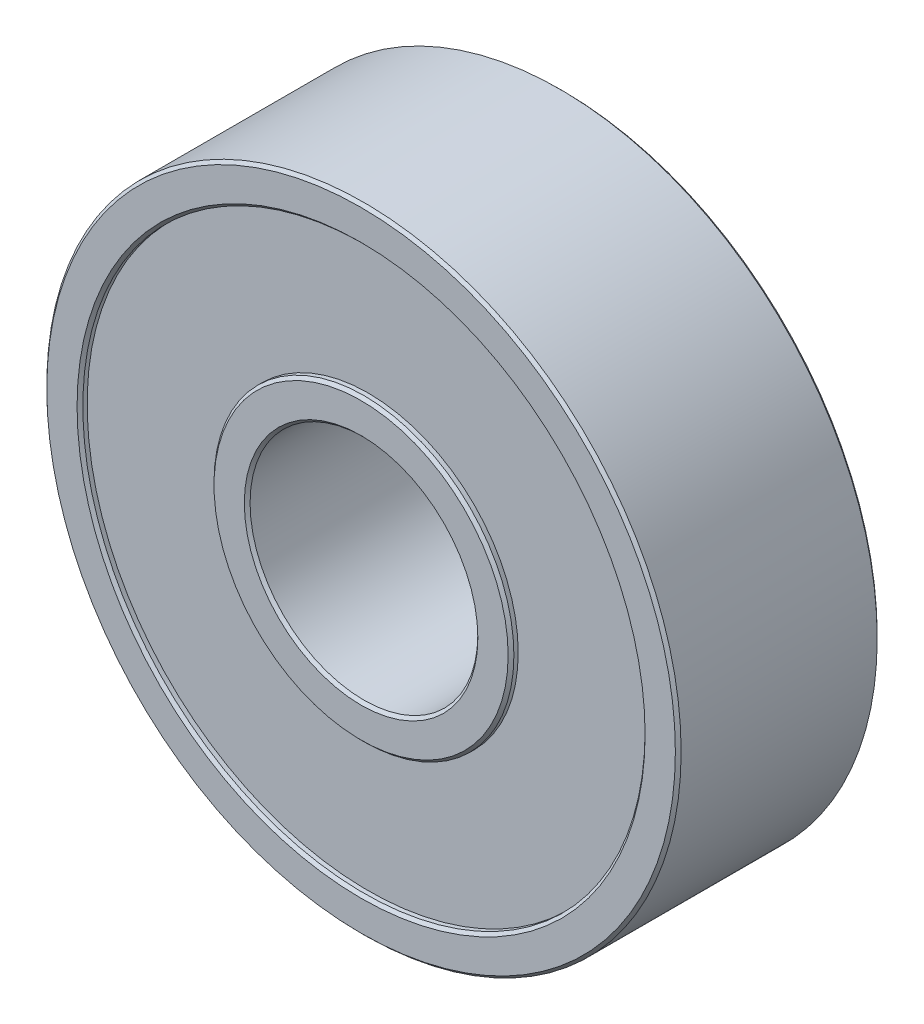
ISO-10303-21;
HEADER;
FILE_DESCRIPTION(('STEP AP214'),'2;1');
FILE_NAME('part.step','',(''),(''),'','','');
FILE_SCHEMA(('AUTOMOTIVE_DESIGN { 1 0 10303 214 1 1 1 1 }'));
ENDSEC;
DATA;
#1=APPLICATION_CONTEXT('core data for automotive mechanical design processes');
#2=APPLICATION_PROTOCOL_DEFINITION('international standard','automotive_design',2000,#1);
#3=PRODUCT_CONTEXT('',#1,'mechanical');
#4=PRODUCT('Part','Part','',(#3));
#5=PRODUCT_RELATED_PRODUCT_CATEGORY('part','',(#4));
#6=PRODUCT_DEFINITION_FORMATION('','',#4);
#7=PRODUCT_DEFINITION_CONTEXT('part definition',#1,'design');
#8=PRODUCT_DEFINITION('design','',#6,#7);
#9=PRODUCT_DEFINITION_SHAPE('','',#8);
#10=(LENGTH_UNIT() NAMED_UNIT(*) SI_UNIT(.MILLI.,.METRE.));
#11=(NAMED_UNIT(*) PLANE_ANGLE_UNIT() SI_UNIT($,.RADIAN.));
#12=(NAMED_UNIT(*) SI_UNIT($,.STERADIAN.) SOLID_ANGLE_UNIT());
#13=UNCERTAINTY_MEASURE_WITH_UNIT(LENGTH_MEASURE(1.E-05),#10,'distance_accuracy_value','');
#14=(GEOMETRIC_REPRESENTATION_CONTEXT(3) GLOBAL_UNCERTAINTY_ASSIGNED_CONTEXT((#13)) GLOBAL_UNIT_ASSIGNED_CONTEXT((#10,
#11,#12)) REPRESENTATION_CONTEXT('',''));
#15=CARTESIAN_POINT('',(0.,0.,0.));
#16=DIRECTION('',(0.,0.,1.));
#17=DIRECTION('',(1.,0.,0.));
#18=AXIS2_PLACEMENT_3D('',#15,#16,#17);
#19=CARTESIAN_POINT('',(0.,0.,3.5));
#20=DIRECTION('',(0.,0.,1.));
#21=DIRECTION('',(1.,0.,0.));
#22=AXIS2_PLACEMENT_3D('',#19,#20,#21);
#23=PLANE('',#22);
#24=CARTESIAN_POINT('',(0.,0.,3.5));
#25=DIRECTION('',(0.,0.,1.));
#26=DIRECTION('',(1.,0.,0.));
#27=AXIS2_PLACEMENT_3D('',#24,#25,#26);
#28=CIRCLE('',#27,5.1);
#29=CARTESIAN_POINT('',(5.1,0.,3.5));
#30=VERTEX_POINT('',#29);
#31=EDGE_CURVE('E53',#30,#30,#28,.T.);
#32=ORIENTED_EDGE('',*,*,#31,.T.);
#33=EDGE_LOOP('',(#32));
#34=FACE_BOUND('',#33,.T.);
#35=CARTESIAN_POINT('',(0.,0.,3.5));
#36=DIRECTION('',(0.,0.,1.));
#37=DIRECTION('',(1.,0.,0.));
#38=AXIS2_PLACEMENT_3D('',#35,#36,#37);
#39=CIRCLE('',#38,4.05000000000001);
#40=CARTESIAN_POINT('',(4.05000000000001,0.,3.5));
#41=VERTEX_POINT('',#40);
#42=EDGE_CURVE('E56',#41,#41,#39,.F.);
#43=ORIENTED_EDGE('',*,*,#42,.T.);
#44=EDGE_LOOP('',(#43));
#45=FACE_BOUND('',#44,.T.);
#46=ADVANCED_FACE('F33',(#34,#45),#23,.T.);
#47=CARTESIAN_POINT('',(0.,0.,-3.5));
#48=DIRECTION('',(0.,0.,1.));
#49=DIRECTION('',(1.,0.,0.));
#50=AXIS2_PLACEMENT_3D('',#47,#48,#49);
#51=PLANE('',#50);
#52=CARTESIAN_POINT('',(0.,0.,-3.5));
#53=DIRECTION('',(0.,0.,1.));
#54=DIRECTION('',(1.,0.,0.));
#55=AXIS2_PLACEMENT_3D('',#52,#53,#54);
#56=CIRCLE('',#55,9.85);
#57=CARTESIAN_POINT('',(9.85,0.,-3.5));
#58=VERTEX_POINT('',#57);
#59=EDGE_CURVE('E68',#58,#58,#56,.T.);
#60=ORIENTED_EDGE('',*,*,#59,.T.);
#61=EDGE_LOOP('',(#60));
#62=FACE_BOUND('',#61,.T.);
#63=CARTESIAN_POINT('',(0.,0.,-3.5));
#64=DIRECTION('',(0.,0.,1.));
#65=DIRECTION('',(1.,0.,0.));
#66=AXIS2_PLACEMENT_3D('',#63,#64,#65);
#67=CIRCLE('',#66,10.9);
#68=CARTESIAN_POINT('',(10.9,0.,-3.5));
#69=VERTEX_POINT('',#68);
#70=EDGE_CURVE('E71',#69,#69,#67,.F.);
#71=ORIENTED_EDGE('',*,*,#70,.T.);
#72=EDGE_LOOP('',(#71));
#73=FACE_BOUND('',#72,.T.);
#74=ADVANCED_FACE('F121',(#62,#73),#51,.F.);
#75=CARTESIAN_POINT('',(0.,0.,-3.5));
#76=DIRECTION('',(0.,0.,1.));
#77=DIRECTION('',(1.,0.,0.));
#78=AXIS2_PLACEMENT_3D('',#75,#76,#77);
#79=CYLINDRICAL_SURFACE('',#78,11.);
#80=CARTESIAN_POINT('',(0.,0.,-3.4));
#81=DIRECTION('',(0.,0.,1.));
#82=DIRECTION('',(1.,0.,0.));
#83=AXIS2_PLACEMENT_3D('',#80,#81,#82);
#84=CIRCLE('',#83,11.);
#85=CARTESIAN_POINT('',(11.,0.,-3.4));
#86=VERTEX_POINT('',#85);
#87=EDGE_CURVE('E59',#86,#86,#84,.T.);
#88=ORIENTED_EDGE('',*,*,#87,.T.);
#89=EDGE_LOOP('',(#88));
#90=FACE_BOUND('',#89,.T.);
#91=CARTESIAN_POINT('',(0.,0.,3.4));
#92=DIRECTION('',(0.,0.,1.));
#93=DIRECTION('',(1.,0.,0.));
#94=AXIS2_PLACEMENT_3D('',#91,#92,#93);
#95=CIRCLE('',#94,11.);
#96=CARTESIAN_POINT('',(11.,0.,3.4));
#97=VERTEX_POINT('',#96);
#98=EDGE_CURVE('E62',#97,#97,#95,.F.);
#99=ORIENTED_EDGE('',*,*,#98,.T.);
#100=EDGE_LOOP('',(#99));
#101=FACE_BOUND('',#100,.T.);
#102=ADVANCED_FACE('F128',(#90,#101),#79,.T.);
#103=CARTESIAN_POINT('',(0.,0.,-3.5));
#104=DIRECTION('',(0.,0.,1.));
#105=DIRECTION('',(1.,0.,0.));
#106=AXIS2_PLACEMENT_3D('',#103,#104,#105);
#107=CIRCLE('',#106,4.05000000000001);
#108=CARTESIAN_POINT('',(4.05000000000001,0.,-3.5));
#109=VERTEX_POINT('',#108);
#110=EDGE_CURVE('E83',#109,#109,#107,.T.);
#111=ORIENTED_EDGE('',*,*,#110,.T.);
#112=EDGE_LOOP('',(#111));
#113=FACE_BOUND('',#112,.T.);
#114=CARTESIAN_POINT('',(0.,0.,-3.5));
#115=DIRECTION('',(0.,0.,1.));
#116=DIRECTION('',(1.,0.,0.));
#117=AXIS2_PLACEMENT_3D('',#114,#115,#116);
#118=CIRCLE('',#117,5.1);
#119=CARTESIAN_POINT('',(5.1,0.,-3.5));
#120=VERTEX_POINT('',#119);
#121=EDGE_CURVE('E86',#120,#120,#118,.F.);
#122=ORIENTED_EDGE('',*,*,#121,.T.);
#123=EDGE_LOOP('',(#122));
#124=FACE_BOUND('',#123,.T.);
#125=ADVANCED_FACE('F131',(#113,#124),#51,.F.);
#126=CARTESIAN_POINT('',(0.,0.,-3.5));
#127=DIRECTION('',(0.,0.,1.));
#128=DIRECTION('',(1.,0.,0.));
#129=AXIS2_PLACEMENT_3D('',#126,#127,#128);
#130=CYLINDRICAL_SURFACE('',#129,3.95);
#131=CARTESIAN_POINT('',(0.,0.,-3.4));
#132=DIRECTION('',(0.,0.,1.));
#133=DIRECTION('',(1.,0.,0.));
#134=AXIS2_PLACEMENT_3D('',#131,#132,#133);
#135=CIRCLE('',#134,3.95);
#136=CARTESIAN_POINT('',(3.95,0.,-3.4));
#137=VERTEX_POINT('',#136);
#138=EDGE_CURVE('E77',#137,#137,#135,.F.);
#139=ORIENTED_EDGE('',*,*,#138,.T.);
#140=EDGE_LOOP('',(#139));
#141=FACE_BOUND('',#140,.T.);
#142=CARTESIAN_POINT('',(0.,0.,3.4));
#143=DIRECTION('',(0.,0.,1.));
#144=DIRECTION('',(1.,0.,0.));
#145=AXIS2_PLACEMENT_3D('',#142,#143,#144);
#146=CIRCLE('',#145,3.95);
#147=CARTESIAN_POINT('',(3.95,0.,3.4));
#148=VERTEX_POINT('',#147);
#149=EDGE_CURVE('E80',#148,#148,#146,.T.);
#150=ORIENTED_EDGE('',*,*,#149,.T.);
#151=EDGE_LOOP('',(#150));
#152=FACE_BOUND('',#151,.T.);
#153=ADVANCED_FACE('F137',(#141,#152),#130,.F.);
#154=CARTESIAN_POINT('',(0.,0.,3.5));
#155=DIRECTION('',(0.,0.,1.));
#156=DIRECTION('',(1.,0.,0.));
#157=AXIS2_PLACEMENT_3D('',#154,#155,#156);
#158=CIRCLE('',#157,10.9);
#159=CARTESIAN_POINT('',(10.9,0.,3.5));
#160=VERTEX_POINT('',#159);
#161=EDGE_CURVE('E40',#160,#160,#158,.T.);
#162=ORIENTED_EDGE('',*,*,#161,.T.);
#163=EDGE_LOOP('',(#162));
#164=FACE_BOUND('',#163,.T.);
#165=CARTESIAN_POINT('',(0.,0.,3.5));
#166=DIRECTION('',(0.,0.,1.));
#167=DIRECTION('',(1.,0.,0.));
#168=AXIS2_PLACEMENT_3D('',#165,#166,#167);
#169=CIRCLE('',#168,9.84999999999999);
#170=CARTESIAN_POINT('',(9.84999999999999,0.,3.5));
#171=VERTEX_POINT('',#170);
#172=EDGE_CURVE('E44',#171,#171,#169,.F.);
#173=ORIENTED_EDGE('',*,*,#172,.T.);
#174=EDGE_LOOP('',(#173));
#175=FACE_BOUND('',#174,.T.);
#176=ADVANCED_FACE('F124',(#164,#175),#23,.T.);
#177=CARTESIAN_POINT('',(0.,0.,-3.25));
#178=DIRECTION('',(0.,0.,1.));
#179=DIRECTION('',(1.,0.,0.));
#180=AXIS2_PLACEMENT_3D('',#177,#178,#179);
#181=PLANE('',#180);
#182=CARTESIAN_POINT('',(0.,0.,-3.25));
#183=DIRECTION('',(0.,0.,1.));
#184=DIRECTION('',(1.,0.,0.));
#185=AXIS2_PLACEMENT_3D('',#182,#183,#184);
#186=CIRCLE('',#185,9.75);
#187=CARTESIAN_POINT('',(9.75,0.,-3.25));
#188=VERTEX_POINT('',#187);
#189=EDGE_CURVE('E89',#188,#188,#186,.T.);
#190=ORIENTED_EDGE('',*,*,#189,.F.);
#191=EDGE_LOOP('',(#190));
#192=FACE_BOUND('',#191,.T.);
#193=CARTESIAN_POINT('',(0.,0.,-3.25));
#194=DIRECTION('',(0.,0.,1.));
#195=DIRECTION('',(1.,0.,0.));
#196=AXIS2_PLACEMENT_3D('',#193,#194,#195);
#197=CIRCLE('',#196,5.2);
#198=CARTESIAN_POINT('',(5.2,0.,-3.25));
#199=VERTEX_POINT('',#198);
#200=EDGE_CURVE('E92',#199,#199,#197,.T.);
#201=ORIENTED_EDGE('',*,*,#200,.T.);
#202=EDGE_LOOP('',(#201));
#203=FACE_BOUND('',#202,.T.);
#204=ADVANCED_FACE('F136',(#192,#203),#181,.F.);
#205=CARTESIAN_POINT('',(0.,0.,-3.25));
#206=DIRECTION('',(0.,0.,-1.));
#207=DIRECTION('',(-1.,0.,0.));
#208=AXIS2_PLACEMENT_3D('',#205,#206,#207);
#209=CYLINDRICAL_SURFACE('',#208,9.75);
#210=CARTESIAN_POINT('',(0.,0.,-3.4));
#211=DIRECTION('',(0.,0.,1.));
#212=DIRECTION('',(1.,0.,0.));
#213=AXIS2_PLACEMENT_3D('',#210,#211,#212);
#214=CIRCLE('',#213,9.75);
#215=CARTESIAN_POINT('',(9.75,0.,-3.4));
#216=VERTEX_POINT('',#215);
#217=EDGE_CURVE('E65',#216,#216,#214,.F.);
#218=ORIENTED_EDGE('',*,*,#217,.T.);
#219=EDGE_LOOP('',(#218));
#220=FACE_BOUND('',#219,.T.);
#221=ORIENTED_EDGE('',*,*,#189,.T.);
#222=EDGE_LOOP('',(#221));
#223=FACE_BOUND('',#222,.T.);
#224=ADVANCED_FACE('F117',(#220,#223),#209,.F.);
#225=CARTESIAN_POINT('',(0.,0.,-3.25));
#226=DIRECTION('',(0.,0.,-1.));
#227=DIRECTION('',(-1.,0.,0.));
#228=AXIS2_PLACEMENT_3D('',#225,#226,#227);
#229=CYLINDRICAL_SURFACE('',#228,5.2);
#230=CARTESIAN_POINT('',(0.,0.,-3.4));
#231=DIRECTION('',(0.,0.,1.));
#232=DIRECTION('',(1.,0.,0.));
#233=AXIS2_PLACEMENT_3D('',#230,#231,#232);
#234=CIRCLE('',#233,5.2);
#235=CARTESIAN_POINT('',(5.2,0.,-3.4));
#236=VERTEX_POINT('',#235);
#237=EDGE_CURVE('E74',#236,#236,#234,.T.);
#238=ORIENTED_EDGE('',*,*,#237,.T.);
#239=EDGE_LOOP('',(#238));
#240=FACE_BOUND('',#239,.T.);
#241=ORIENTED_EDGE('',*,*,#200,.F.);
#242=EDGE_LOOP('',(#241));
#243=FACE_BOUND('',#242,.T.);
#244=ADVANCED_FACE('F112',(#240,#243),#229,.T.);
#245=CARTESIAN_POINT('',(0.,0.,3.25));
#246=DIRECTION('',(0.,0.,1.));
#247=DIRECTION('',(1.,0.,0.));
#248=AXIS2_PLACEMENT_3D('',#245,#246,#247);
#249=CYLINDRICAL_SURFACE('',#248,9.75);
#250=CARTESIAN_POINT('',(0.,0.,3.40000000000001));
#251=DIRECTION('',(0.,0.,1.));
#252=DIRECTION('',(1.,0.,0.));
#253=AXIS2_PLACEMENT_3D('',#250,#251,#252);
#254=CIRCLE('',#253,9.75);
#255=CARTESIAN_POINT('',(9.75,0.,3.40000000000001));
#256=VERTEX_POINT('',#255);
#257=EDGE_CURVE('E10',#256,#256,#254,.T.);
#258=ORIENTED_EDGE('',*,*,#257,.T.);
#259=EDGE_LOOP('',(#258));
#260=FACE_BOUND('',#259,.T.);
#261=CARTESIAN_POINT('',(0.,0.,3.25));
#262=DIRECTION('',(0.,0.,1.));
#263=DIRECTION('',(1.,0.,0.));
#264=AXIS2_PLACEMENT_3D('',#261,#262,#263);
#265=CIRCLE('',#264,9.75);
#266=CARTESIAN_POINT('',(9.75,0.,3.25));
#267=VERTEX_POINT('',#266);
#268=EDGE_CURVE('E95',#267,#267,#265,.T.);
#269=ORIENTED_EDGE('',*,*,#268,.F.);
#270=EDGE_LOOP('',(#269));
#271=FACE_BOUND('',#270,.T.);
#272=ADVANCED_FACE('F107',(#260,#271),#249,.F.);
#273=CARTESIAN_POINT('',(0.,0.,3.25));
#274=DIRECTION('',(0.,0.,1.));
#275=DIRECTION('',(1.,0.,0.));
#276=AXIS2_PLACEMENT_3D('',#273,#274,#275);
#277=PLANE('',#276);
#278=CARTESIAN_POINT('',(0.,0.,3.25));
#279=DIRECTION('',(0.,0.,1.));
#280=DIRECTION('',(1.,0.,0.));
#281=AXIS2_PLACEMENT_3D('',#278,#279,#280);
#282=CIRCLE('',#281,5.2);
#283=CARTESIAN_POINT('',(5.2,0.,3.25));
#284=VERTEX_POINT('',#283);
#285=EDGE_CURVE('E98',#284,#284,#282,.T.);
#286=ORIENTED_EDGE('',*,*,#285,.F.);
#287=EDGE_LOOP('',(#286));
#288=FACE_BOUND('',#287,.T.);
#289=ORIENTED_EDGE('',*,*,#268,.T.);
#290=EDGE_LOOP('',(#289));
#291=FACE_BOUND('',#290,.T.);
#292=ADVANCED_FACE('F104',(#288,#291),#277,.T.);
#293=CARTESIAN_POINT('',(0.,0.,3.25));
#294=DIRECTION('',(0.,0.,1.));
#295=DIRECTION('',(1.,0.,0.));
#296=AXIS2_PLACEMENT_3D('',#293,#294,#295);
#297=CYLINDRICAL_SURFACE('',#296,5.2);
#298=CARTESIAN_POINT('',(0.,0.,3.4));
#299=DIRECTION('',(0.,0.,1.));
#300=DIRECTION('',(1.,0.,0.));
#301=AXIS2_PLACEMENT_3D('',#298,#299,#300);
#302=CIRCLE('',#301,5.2);
#303=CARTESIAN_POINT('',(5.2,0.,3.4));
#304=VERTEX_POINT('',#303);
#305=EDGE_CURVE('E48',#304,#304,#302,.F.);
#306=ORIENTED_EDGE('',*,*,#305,.T.);
#307=EDGE_LOOP('',(#306));
#308=FACE_BOUND('',#307,.T.);
#309=ORIENTED_EDGE('',*,*,#285,.T.);
#310=EDGE_LOOP('',(#309));
#311=FACE_BOUND('',#310,.T.);
#312=ADVANCED_FACE('F102',(#308,#311),#297,.T.);
#313=CARTESIAN_POINT('',(0.,0.,-3.5));
#314=DIRECTION('',(0.,0.,-1.));
#315=DIRECTION('',(-1.,0.,0.));
#316=AXIS2_PLACEMENT_3D('',#313,#314,#315);
#317=CONICAL_SURFACE('',#316,4.05000000000001,0.785398163397466);
#318=ORIENTED_EDGE('',*,*,#138,.F.);
#319=EDGE_LOOP('',(#318));
#320=FACE_BOUND('',#319,.T.);
#321=ORIENTED_EDGE('',*,*,#110,.F.);
#322=EDGE_LOOP('',(#321));
#323=FACE_BOUND('',#322,.T.);
#324=ADVANCED_FACE('F179',(#320,#323),#317,.F.);
#325=CARTESIAN_POINT('',(0.,0.,-3.4));
#326=DIRECTION('',(0.,0.,1.));
#327=DIRECTION('',(1.,0.,0.));
#328=AXIS2_PLACEMENT_3D('',#325,#326,#327);
#329=CONICAL_SURFACE('',#328,5.2,0.785398163397448);
#330=ORIENTED_EDGE('',*,*,#121,.F.);
#331=EDGE_LOOP('',(#330));
#332=FACE_BOUND('',#331,.T.);
#333=ORIENTED_EDGE('',*,*,#237,.F.);
#334=EDGE_LOOP('',(#333));
#335=FACE_BOUND('',#334,.T.);
#336=ADVANCED_FACE('F175',(#332,#335),#329,.T.);
#337=CARTESIAN_POINT('',(0.,0.,-3.5));
#338=DIRECTION('',(0.,0.,-1.));
#339=DIRECTION('',(-1.,0.,0.));
#340=AXIS2_PLACEMENT_3D('',#337,#338,#339);
#341=CONICAL_SURFACE('',#340,9.85,0.785398163397466);
#342=ORIENTED_EDGE('',*,*,#217,.F.);
#343=EDGE_LOOP('',(#342));
#344=FACE_BOUND('',#343,.T.);
#345=ORIENTED_EDGE('',*,*,#59,.F.);
#346=EDGE_LOOP('',(#345));
#347=FACE_BOUND('',#346,.T.);
#348=ADVANCED_FACE('F171',(#344,#347),#341,.F.);
#349=CARTESIAN_POINT('',(0.,0.,-3.4));
#350=DIRECTION('',(0.,0.,1.));
#351=DIRECTION('',(1.,0.,0.));
#352=AXIS2_PLACEMENT_3D('',#349,#350,#351);
#353=CONICAL_SURFACE('',#352,11.,0.78539816339744);
#354=ORIENTED_EDGE('',*,*,#70,.F.);
#355=EDGE_LOOP('',(#354));
#356=FACE_BOUND('',#355,.T.);
#357=ORIENTED_EDGE('',*,*,#87,.F.);
#358=EDGE_LOOP('',(#357));
#359=FACE_BOUND('',#358,.T.);
#360=ADVANCED_FACE('F167',(#356,#359),#353,.T.);
#361=CARTESIAN_POINT('',(0.,0.,3.5));
#362=DIRECTION('',(0.,0.,-1.));
#363=DIRECTION('',(-1.,0.,0.));
#364=AXIS2_PLACEMENT_3D('',#361,#362,#363);
#365=CONICAL_SURFACE('',#364,5.1,0.785398163397453);
#366=ORIENTED_EDGE('',*,*,#305,.F.);
#367=EDGE_LOOP('',(#366));
#368=FACE_BOUND('',#367,.T.);
#369=ORIENTED_EDGE('',*,*,#31,.F.);
#370=EDGE_LOOP('',(#369));
#371=FACE_BOUND('',#370,.T.);
#372=ADVANCED_FACE('F159',(#368,#371),#365,.T.);
#373=CARTESIAN_POINT('',(0.,0.,3.4));
#374=DIRECTION('',(0.,0.,1.));
#375=DIRECTION('',(1.,0.,0.));
#376=AXIS2_PLACEMENT_3D('',#373,#374,#375);
#377=CONICAL_SURFACE('',#376,3.95,0.785398163397448);
#378=ORIENTED_EDGE('',*,*,#42,.F.);
#379=EDGE_LOOP('',(#378));
#380=FACE_BOUND('',#379,.T.);
#381=ORIENTED_EDGE('',*,*,#149,.F.);
#382=EDGE_LOOP('',(#381));
#383=FACE_BOUND('',#382,.T.);
#384=ADVANCED_FACE('F154',(#380,#383),#377,.F.);
#385=CARTESIAN_POINT('',(0.,0.,3.5));
#386=DIRECTION('',(0.,0.,-1.));
#387=DIRECTION('',(-1.,0.,0.));
#388=AXIS2_PLACEMENT_3D('',#385,#386,#387);
#389=CONICAL_SURFACE('',#388,10.9,0.785398163397448);
#390=ORIENTED_EDGE('',*,*,#98,.F.);
#391=EDGE_LOOP('',(#390));
#392=FACE_BOUND('',#391,.T.);
#393=ORIENTED_EDGE('',*,*,#161,.F.);
#394=EDGE_LOOP('',(#393));
#395=FACE_BOUND('',#394,.T.);
#396=ADVANCED_FACE('F150',(#392,#395),#389,.T.);
#397=CARTESIAN_POINT('',(0.,0.,3.40000000000001));
#398=DIRECTION('',(0.,0.,1.));
#399=DIRECTION('',(1.,0.,0.));
#400=AXIS2_PLACEMENT_3D('',#397,#398,#399);
#401=CONICAL_SURFACE('',#400,9.75,0.785398163397448);
#402=ORIENTED_EDGE('',*,*,#172,.F.);
#403=EDGE_LOOP('',(#402));
#404=FACE_BOUND('',#403,.T.);
#405=ORIENTED_EDGE('',*,*,#257,.F.);
#406=EDGE_LOOP('',(#405));
#407=FACE_BOUND('',#406,.T.);
#408=ADVANCED_FACE('F35',(#404,#407),#401,.F.);
#409=CLOSED_SHELL('',(#46,#74,#102,#125,#153,#176,#204,#224,#244,#272,#292,#312,#324,#336,#348,
#360,#372,#384,#396,#408));
#410=MANIFOLD_SOLID_BREP('B2',#409);
#411=ADVANCED_BREP_SHAPE_REPRESENTATION('',(#18,#410),#14);
#412=SHAPE_DEFINITION_REPRESENTATION(#9,#411);
ENDSEC;
END-ISO-10303-21;
